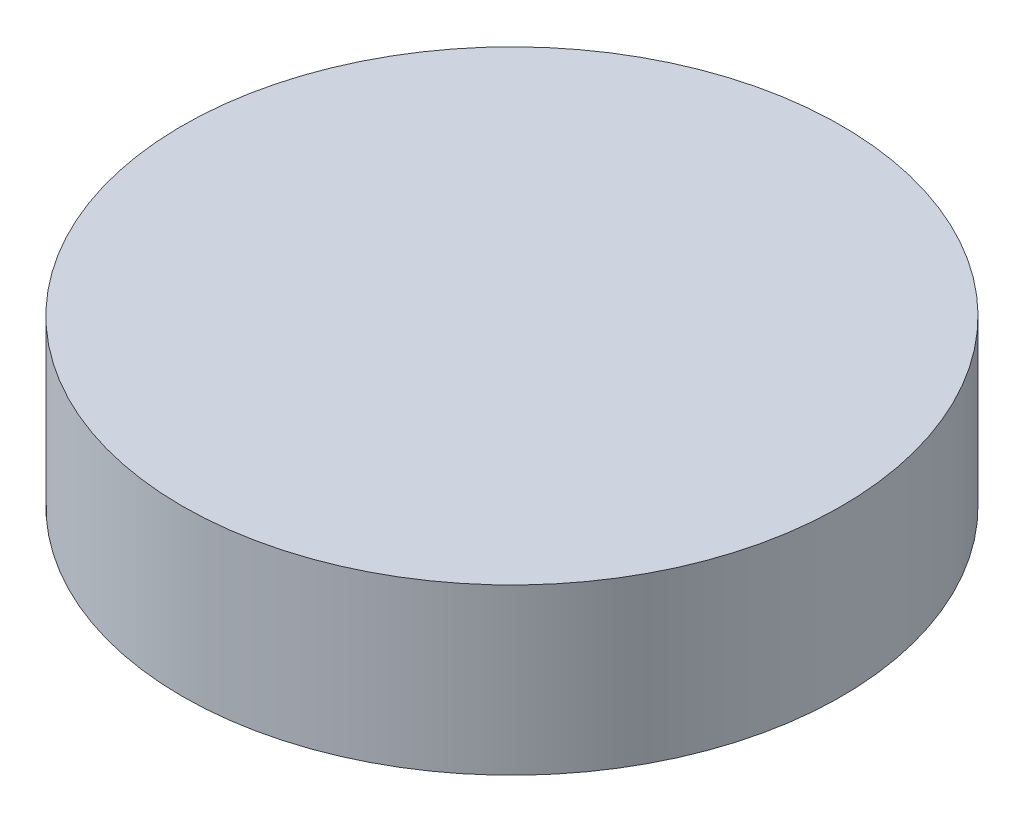
ISO-10303-21;
HEADER;
FILE_DESCRIPTION(('STEP AP214'),'2;1');
FILE_NAME('part.step','',(''),(''),'','','');
FILE_SCHEMA(('AUTOMOTIVE_DESIGN { 1 0 10303 214 1 1 1 1 }'));
ENDSEC;
DATA;
#1=APPLICATION_CONTEXT('core data for automotive mechanical design processes');
#2=APPLICATION_PROTOCOL_DEFINITION('international standard','automotive_design',2000,#1);
#3=PRODUCT_CONTEXT('',#1,'mechanical');
#4=PRODUCT('Part','Part','',(#3));
#5=PRODUCT_RELATED_PRODUCT_CATEGORY('part','',(#4));
#6=PRODUCT_DEFINITION_FORMATION('','',#4);
#7=PRODUCT_DEFINITION_CONTEXT('part definition',#1,'design');
#8=PRODUCT_DEFINITION('design','',#6,#7);
#9=PRODUCT_DEFINITION_SHAPE('','',#8);
#10=(LENGTH_UNIT() NAMED_UNIT(*) SI_UNIT(.MILLI.,.METRE.));
#11=(NAMED_UNIT(*) PLANE_ANGLE_UNIT() SI_UNIT($,.RADIAN.));
#12=(NAMED_UNIT(*) SI_UNIT($,.STERADIAN.) SOLID_ANGLE_UNIT());
#13=UNCERTAINTY_MEASURE_WITH_UNIT(LENGTH_MEASURE(1.E-05),#10,'distance_accuracy_value','');
#14=(GEOMETRIC_REPRESENTATION_CONTEXT(3) GLOBAL_UNCERTAINTY_ASSIGNED_CONTEXT((#13)) GLOBAL_UNIT_ASSIGNED_CONTEXT((#10,
#11,#12)) REPRESENTATION_CONTEXT('',''));
#15=CARTESIAN_POINT('',(0.,0.,0.));
#16=DIRECTION('',(0.,0.,1.));
#17=DIRECTION('',(1.,0.,0.));
#18=AXIS2_PLACEMENT_3D('',#15,#16,#17);
#19=CARTESIAN_POINT('',(0.,10.,0.));
#20=DIRECTION('',(0.,-1.,0.));
#21=DIRECTION('',(0.,0.,-1.));
#22=AXIS2_PLACEMENT_3D('',#19,#20,#21);
#23=CYLINDRICAL_SURFACE('',#22,20.);
#24=CARTESIAN_POINT('',(0.,10.,0.));
#25=DIRECTION('',(0.,1.,0.));
#26=DIRECTION('',(0.,0.,1.));
#27=AXIS2_PLACEMENT_3D('',#24,#25,#26);
#28=CIRCLE('',#27,20.);
#29=CARTESIAN_POINT('',(0.,10.,20.));
#30=VERTEX_POINT('',#29);
#31=EDGE_CURVE('E10',#30,#30,#28,.T.);
#32=ORIENTED_EDGE('',*,*,#31,.F.);
#33=EDGE_LOOP('',(#32));
#34=FACE_BOUND('',#33,.T.);
#35=CARTESIAN_POINT('',(0.,0.,0.));
#36=DIRECTION('',(0.,1.,0.));
#37=DIRECTION('',(0.,0.,1.));
#38=AXIS2_PLACEMENT_3D('',#35,#36,#37);
#39=CIRCLE('',#38,20.);
#40=CARTESIAN_POINT('',(0.,0.,20.));
#41=VERTEX_POINT('',#40);
#42=EDGE_CURVE('E36',#41,#41,#39,.T.);
#43=ORIENTED_EDGE('',*,*,#42,.T.);
#44=EDGE_LOOP('',(#43));
#45=FACE_BOUND('',#44,.T.);
#46=ADVANCED_FACE('F33',(#34,#45),#23,.T.);
#47=CARTESIAN_POINT('',(0.,10.,0.));
#48=DIRECTION('',(0.,1.,0.));
#49=DIRECTION('',(0.,0.,1.));
#50=AXIS2_PLACEMENT_3D('',#47,#48,#49);
#51=PLANE('',#50);
#52=ORIENTED_EDGE('',*,*,#31,.T.);
#53=EDGE_LOOP('',(#52));
#54=FACE_BOUND('',#53,.T.);
#55=ADVANCED_FACE('F48',(#54),#51,.T.);
#56=CARTESIAN_POINT('',(0.,0.,0.));
#57=DIRECTION('',(0.,1.,0.));
#58=DIRECTION('',(0.,0.,1.));
#59=AXIS2_PLACEMENT_3D('',#56,#57,#58);
#60=PLANE('',#59);
#61=ORIENTED_EDGE('',*,*,#42,.F.);
#62=EDGE_LOOP('',(#61));
#63=FACE_BOUND('',#62,.T.);
#64=ADVANCED_FACE('F46',(#63),#60,.F.);
#65=CLOSED_SHELL('',(#46,#55,#64));
#66=MANIFOLD_SOLID_BREP('B2',#65);
#67=ADVANCED_BREP_SHAPE_REPRESENTATION('',(#18,#66),#14);
#68=SHAPE_DEFINITION_REPRESENTATION(#9,#67);
ENDSEC;
END-ISO-10303-21;
